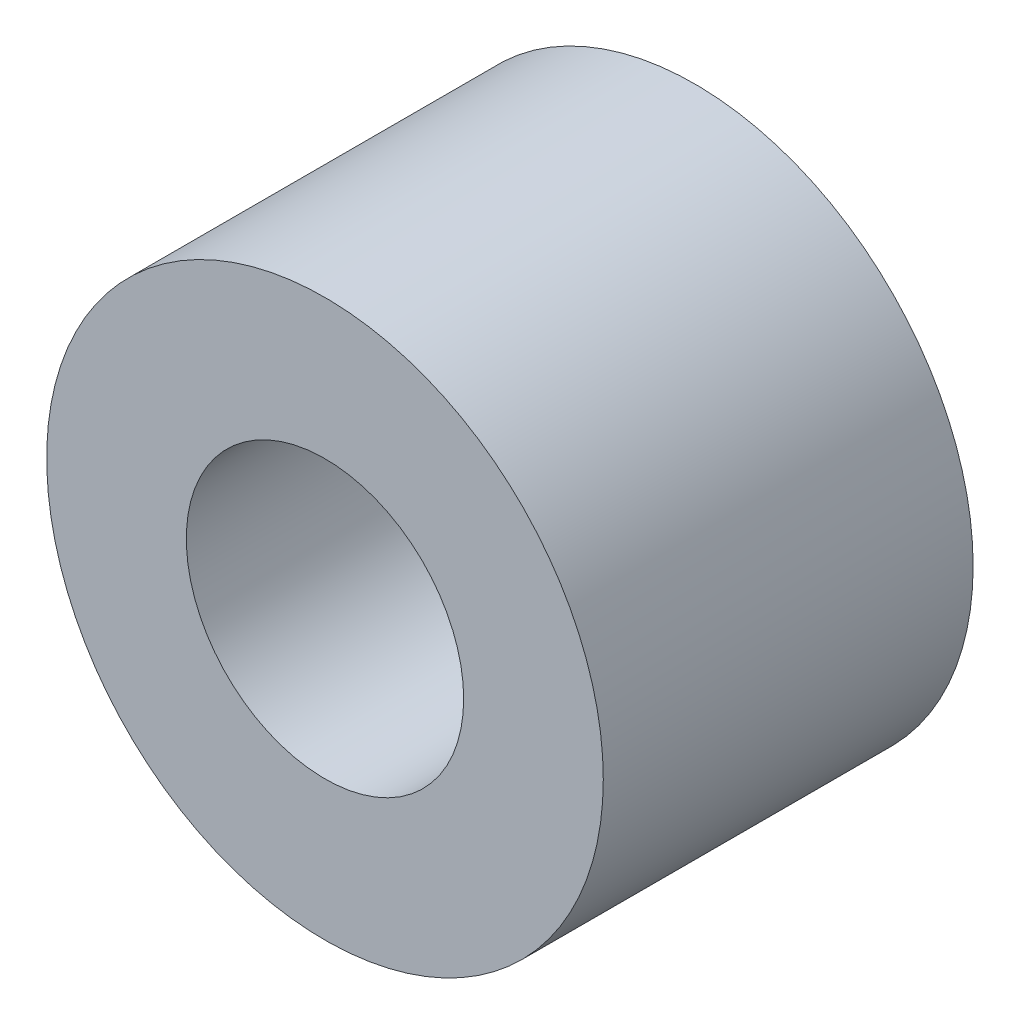
ISO-10303-21;
HEADER;
FILE_DESCRIPTION(('STEP AP214'),'2;1');
FILE_NAME('part.step','',(''),(''),'','','');
FILE_SCHEMA(('AUTOMOTIVE_DESIGN { 1 0 10303 214 1 1 1 1 }'));
ENDSEC;
DATA;
#1=APPLICATION_CONTEXT('core data for automotive mechanical design processes');
#2=APPLICATION_PROTOCOL_DEFINITION('international standard','automotive_design',2000,#1);
#3=PRODUCT_CONTEXT('',#1,'mechanical');
#4=PRODUCT('Part','Part','',(#3));
#5=PRODUCT_RELATED_PRODUCT_CATEGORY('part','',(#4));
#6=PRODUCT_DEFINITION_FORMATION('','',#4);
#7=PRODUCT_DEFINITION_CONTEXT('part definition',#1,'design');
#8=PRODUCT_DEFINITION('design','',#6,#7);
#9=PRODUCT_DEFINITION_SHAPE('','',#8);
#10=(LENGTH_UNIT() NAMED_UNIT(*) SI_UNIT(.MILLI.,.METRE.));
#11=(NAMED_UNIT(*) PLANE_ANGLE_UNIT() SI_UNIT($,.RADIAN.));
#12=(NAMED_UNIT(*) SI_UNIT($,.STERADIAN.) SOLID_ANGLE_UNIT());
#13=UNCERTAINTY_MEASURE_WITH_UNIT(LENGTH_MEASURE(1.E-05),#10,'distance_accuracy_value','');
#14=(GEOMETRIC_REPRESENTATION_CONTEXT(3) GLOBAL_UNCERTAINTY_ASSIGNED_CONTEXT((#13)) GLOBAL_UNIT_ASSIGNED_CONTEXT((#10,
#11,#12)) REPRESENTATION_CONTEXT('',''));
#15=CARTESIAN_POINT('',(0.,0.,0.));
#16=DIRECTION('',(0.,0.,1.));
#17=DIRECTION('',(1.,0.,0.));
#18=AXIS2_PLACEMENT_3D('',#15,#16,#17);
#19=CARTESIAN_POINT('',(0.,0.,2.));
#20=DIRECTION('',(0.,0.,1.));
#21=DIRECTION('',(1.,0.,0.));
#22=AXIS2_PLACEMENT_3D('',#19,#20,#21);
#23=PLANE('',#22);
#24=CARTESIAN_POINT('',(0.,0.,2.));
#25=DIRECTION('',(0.,0.,1.));
#26=DIRECTION('',(1.,0.,0.));
#27=AXIS2_PLACEMENT_3D('',#24,#25,#26);
#28=CIRCLE('',#27,3.01);
#29=CARTESIAN_POINT('',(3.01,0.,2.));
#30=VERTEX_POINT('',#29);
#31=EDGE_CURVE('E10',#30,#30,#28,.T.);
#32=ORIENTED_EDGE('',*,*,#31,.T.);
#33=EDGE_LOOP('',(#32));
#34=FACE_BOUND('',#33,.T.);
#35=CARTESIAN_POINT('',(0.,0.,2.));
#36=DIRECTION('',(0.,0.,1.));
#37=DIRECTION('',(1.,0.,0.));
#38=AXIS2_PLACEMENT_3D('',#35,#36,#37);
#39=CIRCLE('',#38,1.5);
#40=CARTESIAN_POINT('',(1.5,0.,2.));
#41=VERTEX_POINT('',#40);
#42=EDGE_CURVE('E43',#41,#41,#39,.T.);
#43=ORIENTED_EDGE('',*,*,#42,.F.);
#44=EDGE_LOOP('',(#43));
#45=FACE_BOUND('',#44,.T.);
#46=ADVANCED_FACE('F32',(#34,#45),#23,.T.);
#47=CARTESIAN_POINT('',(0.,0.,-2.));
#48=DIRECTION('',(0.,0.,1.));
#49=DIRECTION('',(1.,0.,0.));
#50=AXIS2_PLACEMENT_3D('',#47,#48,#49);
#51=PLANE('',#50);
#52=CARTESIAN_POINT('',(0.,0.,-2.));
#53=DIRECTION('',(0.,0.,1.));
#54=DIRECTION('',(1.,0.,0.));
#55=AXIS2_PLACEMENT_3D('',#52,#53,#54);
#56=CIRCLE('',#55,3.01);
#57=CARTESIAN_POINT('',(3.01,0.,-2.));
#58=VERTEX_POINT('',#57);
#59=EDGE_CURVE('E36',#58,#58,#56,.T.);
#60=ORIENTED_EDGE('',*,*,#59,.F.);
#61=EDGE_LOOP('',(#60));
#62=FACE_BOUND('',#61,.T.);
#63=CARTESIAN_POINT('',(0.,0.,-2.));
#64=DIRECTION('',(0.,0.,1.));
#65=DIRECTION('',(1.,0.,0.));
#66=AXIS2_PLACEMENT_3D('',#63,#64,#65);
#67=CIRCLE('',#66,1.5);
#68=CARTESIAN_POINT('',(1.5,0.,-2.));
#69=VERTEX_POINT('',#68);
#70=EDGE_CURVE('E45',#69,#69,#67,.T.);
#71=ORIENTED_EDGE('',*,*,#70,.T.);
#72=EDGE_LOOP('',(#71));
#73=FACE_BOUND('',#72,.T.);
#74=ADVANCED_FACE('F55',(#62,#73),#51,.F.);
#75=CARTESIAN_POINT('',(0.,0.,2.));
#76=DIRECTION('',(0.,0.,-1.));
#77=DIRECTION('',(-1.,0.,0.));
#78=AXIS2_PLACEMENT_3D('',#75,#76,#77);
#79=CYLINDRICAL_SURFACE('',#78,3.01);
#80=ORIENTED_EDGE('',*,*,#31,.F.);
#81=EDGE_LOOP('',(#80));
#82=FACE_BOUND('',#81,.T.);
#83=ORIENTED_EDGE('',*,*,#59,.T.);
#84=EDGE_LOOP('',(#83));
#85=FACE_BOUND('',#84,.T.);
#86=ADVANCED_FACE('F34',(#82,#85),#79,.T.);
#87=CARTESIAN_POINT('',(0.,0.,2.));
#88=DIRECTION('',(0.,0.,-1.));
#89=DIRECTION('',(-1.,0.,0.));
#90=AXIS2_PLACEMENT_3D('',#87,#88,#89);
#91=CYLINDRICAL_SURFACE('',#90,1.5);
#92=ORIENTED_EDGE('',*,*,#42,.T.);
#93=EDGE_LOOP('',(#92));
#94=FACE_BOUND('',#93,.T.);
#95=ORIENTED_EDGE('',*,*,#70,.F.);
#96=EDGE_LOOP('',(#95));
#97=FACE_BOUND('',#96,.T.);
#98=ADVANCED_FACE('F51',(#94,#97),#91,.F.);
#99=CLOSED_SHELL('',(#46,#74,#86,#98));
#100=MANIFOLD_SOLID_BREP('B2',#99);
#101=ADVANCED_BREP_SHAPE_REPRESENTATION('',(#18,#100),#14);
#102=SHAPE_DEFINITION_REPRESENTATION(#9,#101);
ENDSEC;
END-ISO-10303-21;
